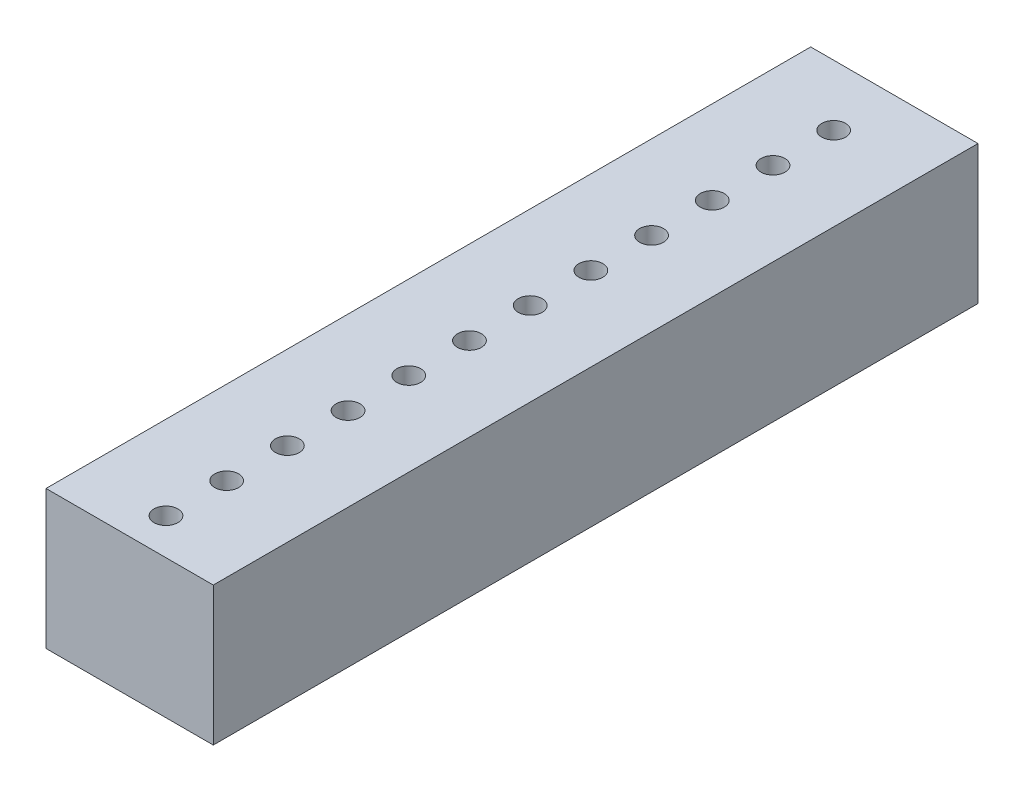
ISO-10303-21;
HEADER;
FILE_DESCRIPTION(('STEP AP214'),'2;1');
FILE_NAME('part.step','',(''),(''),'','','');
FILE_SCHEMA(('AUTOMOTIVE_DESIGN { 1 0 10303 214 1 1 1 1 }'));
ENDSEC;
DATA;
#1=APPLICATION_CONTEXT('core data for automotive mechanical design processes');
#2=APPLICATION_PROTOCOL_DEFINITION('international standard','automotive_design',2000,#1);
#3=PRODUCT_CONTEXT('',#1,'mechanical');
#4=PRODUCT('Part','Part','',(#3));
#5=PRODUCT_RELATED_PRODUCT_CATEGORY('part','',(#4));
#6=PRODUCT_DEFINITION_FORMATION('','',#4);
#7=PRODUCT_DEFINITION_CONTEXT('part definition',#1,'design');
#8=PRODUCT_DEFINITION('design','',#6,#7);
#9=PRODUCT_DEFINITION_SHAPE('','',#8);
#10=(LENGTH_UNIT() NAMED_UNIT(*) SI_UNIT(.MILLI.,.METRE.));
#11=(NAMED_UNIT(*) PLANE_ANGLE_UNIT() SI_UNIT($,.RADIAN.));
#12=(NAMED_UNIT(*) SI_UNIT($,.STERADIAN.) SOLID_ANGLE_UNIT());
#13=UNCERTAINTY_MEASURE_WITH_UNIT(LENGTH_MEASURE(1.E-05),#10,'distance_accuracy_value','');
#14=(GEOMETRIC_REPRESENTATION_CONTEXT(3) GLOBAL_UNCERTAINTY_ASSIGNED_CONTEXT((#13)) GLOBAL_UNIT_ASSIGNED_CONTEXT((#10,
#11,#12)) REPRESENTATION_CONTEXT('',''));
#15=CARTESIAN_POINT('',(0.,0.,0.));
#16=DIRECTION('',(0.,0.,1.));
#17=DIRECTION('',(1.,0.,0.));
#18=AXIS2_PLACEMENT_3D('',#15,#16,#17);
#19=CARTESIAN_POINT('',(0.,-2.9,14.48));
#20=DIRECTION('',(0.,1.,0.));
#21=DIRECTION('',(0.,0.,1.));
#22=AXIS2_PLACEMENT_3D('',#19,#20,#21);
#23=CYLINDRICAL_SURFACE('',#22,0.5);
#24=CARTESIAN_POINT('',(0.,-2.9,14.48));
#25=DIRECTION('',(0.,1.,0.));
#26=DIRECTION('',(0.,0.,1.));
#27=AXIS2_PLACEMENT_3D('',#24,#25,#26);
#28=CIRCLE('',#27,0.5);
#29=CARTESIAN_POINT('',(0.,-2.9,14.98));
#30=VERTEX_POINT('',#29);
#31=EDGE_CURVE('E40',#30,#30,#28,.T.);
#32=ORIENTED_EDGE('',*,*,#31,.F.);
#33=EDGE_LOOP('',(#32));
#34=FACE_BOUND('',#33,.T.);
#35=CARTESIAN_POINT('',(0.,2.9,14.48));
#36=DIRECTION('',(0.,1.,0.));
#37=DIRECTION('',(0.,0.,1.));
#38=AXIS2_PLACEMENT_3D('',#35,#36,#37);
#39=CIRCLE('',#38,0.5);
#40=CARTESIAN_POINT('',(0.,2.9,14.98));
#41=VERTEX_POINT('',#40);
#42=EDGE_CURVE('E11',#41,#41,#39,.T.);
#43=ORIENTED_EDGE('',*,*,#42,.T.);
#44=EDGE_LOOP('',(#43));
#45=FACE_BOUND('',#44,.T.);
#46=ADVANCED_FACE('F32',(#34,#45),#23,.F.);
#47=CARTESIAN_POINT('',(0.,-2.9,11.94));
#48=DIRECTION('',(0.,1.,0.));
#49=DIRECTION('',(0.,0.,1.));
#50=AXIS2_PLACEMENT_3D('',#47,#48,#49);
#51=CYLINDRICAL_SURFACE('',#50,0.5);
#52=CARTESIAN_POINT('',(0.,-2.9,11.94));
#53=DIRECTION('',(0.,1.,0.));
#54=DIRECTION('',(0.,0.,1.));
#55=AXIS2_PLACEMENT_3D('',#52,#53,#54);
#56=CIRCLE('',#55,0.5);
#57=CARTESIAN_POINT('',(0.,-2.9,12.44));
#58=VERTEX_POINT('',#57);
#59=EDGE_CURVE('E161',#58,#58,#56,.T.);
#60=ORIENTED_EDGE('',*,*,#59,.F.);
#61=EDGE_LOOP('',(#60));
#62=FACE_BOUND('',#61,.T.);
#63=CARTESIAN_POINT('',(0.,2.9,11.94));
#64=DIRECTION('',(0.,1.,0.));
#65=DIRECTION('',(0.,0.,1.));
#66=AXIS2_PLACEMENT_3D('',#63,#64,#65);
#67=CIRCLE('',#66,0.5);
#68=CARTESIAN_POINT('',(0.,2.9,12.44));
#69=VERTEX_POINT('',#68);
#70=EDGE_CURVE('E164',#69,#69,#67,.T.);
#71=ORIENTED_EDGE('',*,*,#70,.T.);
#72=EDGE_LOOP('',(#71));
#73=FACE_BOUND('',#72,.T.);
#74=ADVANCED_FACE('F173',(#62,#73),#51,.F.);
#75=CARTESIAN_POINT('',(0.,-2.9,9.4));
#76=DIRECTION('',(0.,1.,0.));
#77=DIRECTION('',(0.,0.,1.));
#78=AXIS2_PLACEMENT_3D('',#75,#76,#77);
#79=CYLINDRICAL_SURFACE('',#78,0.5);
#80=CARTESIAN_POINT('',(0.,-2.9,9.4));
#81=DIRECTION('',(0.,1.,0.));
#82=DIRECTION('',(0.,0.,1.));
#83=AXIS2_PLACEMENT_3D('',#80,#81,#82);
#84=CIRCLE('',#83,0.5);
#85=CARTESIAN_POINT('',(0.,-2.9,9.9));
#86=VERTEX_POINT('',#85);
#87=EDGE_CURVE('E155',#86,#86,#84,.T.);
#88=ORIENTED_EDGE('',*,*,#87,.F.);
#89=EDGE_LOOP('',(#88));
#90=FACE_BOUND('',#89,.T.);
#91=CARTESIAN_POINT('',(0.,2.9,9.4));
#92=DIRECTION('',(0.,1.,0.));
#93=DIRECTION('',(0.,0.,1.));
#94=AXIS2_PLACEMENT_3D('',#91,#92,#93);
#95=CIRCLE('',#94,0.5);
#96=CARTESIAN_POINT('',(0.,2.9,9.9));
#97=VERTEX_POINT('',#96);
#98=EDGE_CURVE('E158',#97,#97,#95,.T.);
#99=ORIENTED_EDGE('',*,*,#98,.T.);
#100=EDGE_LOOP('',(#99));
#101=FACE_BOUND('',#100,.T.);
#102=ADVANCED_FACE('F227',(#90,#101),#79,.F.);
#103=CARTESIAN_POINT('',(0.,-2.9,6.86));
#104=DIRECTION('',(0.,1.,0.));
#105=DIRECTION('',(0.,0.,1.));
#106=AXIS2_PLACEMENT_3D('',#103,#104,#105);
#107=CYLINDRICAL_SURFACE('',#106,0.5);
#108=CARTESIAN_POINT('',(0.,-2.9,6.86));
#109=DIRECTION('',(0.,1.,0.));
#110=DIRECTION('',(0.,0.,1.));
#111=AXIS2_PLACEMENT_3D('',#108,#109,#110);
#112=CIRCLE('',#111,0.5);
#113=CARTESIAN_POINT('',(0.,-2.9,7.36));
#114=VERTEX_POINT('',#113);
#115=EDGE_CURVE('E149',#114,#114,#112,.T.);
#116=ORIENTED_EDGE('',*,*,#115,.F.);
#117=EDGE_LOOP('',(#116));
#118=FACE_BOUND('',#117,.T.);
#119=CARTESIAN_POINT('',(0.,2.9,6.86));
#120=DIRECTION('',(0.,1.,0.));
#121=DIRECTION('',(0.,0.,1.));
#122=AXIS2_PLACEMENT_3D('',#119,#120,#121);
#123=CIRCLE('',#122,0.5);
#124=CARTESIAN_POINT('',(0.,2.9,7.36));
#125=VERTEX_POINT('',#124);
#126=EDGE_CURVE('E152',#125,#125,#123,.T.);
#127=ORIENTED_EDGE('',*,*,#126,.T.);
#128=EDGE_LOOP('',(#127));
#129=FACE_BOUND('',#128,.T.);
#130=ADVANCED_FACE('F223',(#118,#129),#107,.F.);
#131=CARTESIAN_POINT('',(0.,-2.9,4.32));
#132=DIRECTION('',(0.,1.,0.));
#133=DIRECTION('',(0.,0.,1.));
#134=AXIS2_PLACEMENT_3D('',#131,#132,#133);
#135=CYLINDRICAL_SURFACE('',#134,0.5);
#136=CARTESIAN_POINT('',(0.,-2.9,4.32));
#137=DIRECTION('',(0.,1.,0.));
#138=DIRECTION('',(0.,0.,1.));
#139=AXIS2_PLACEMENT_3D('',#136,#137,#138);
#140=CIRCLE('',#139,0.5);
#141=CARTESIAN_POINT('',(0.,-2.9,4.82));
#142=VERTEX_POINT('',#141);
#143=EDGE_CURVE('E143',#142,#142,#140,.T.);
#144=ORIENTED_EDGE('',*,*,#143,.F.);
#145=EDGE_LOOP('',(#144));
#146=FACE_BOUND('',#145,.T.);
#147=CARTESIAN_POINT('',(0.,2.9,4.32));
#148=DIRECTION('',(0.,1.,0.));
#149=DIRECTION('',(0.,0.,1.));
#150=AXIS2_PLACEMENT_3D('',#147,#148,#149);
#151=CIRCLE('',#150,0.5);
#152=CARTESIAN_POINT('',(0.,2.9,4.82));
#153=VERTEX_POINT('',#152);
#154=EDGE_CURVE('E146',#153,#153,#151,.T.);
#155=ORIENTED_EDGE('',*,*,#154,.T.);
#156=EDGE_LOOP('',(#155));
#157=FACE_BOUND('',#156,.T.);
#158=ADVANCED_FACE('F219',(#146,#157),#135,.F.);
#159=CARTESIAN_POINT('',(0.,-2.9,1.78));
#160=DIRECTION('',(0.,1.,0.));
#161=DIRECTION('',(0.,0.,1.));
#162=AXIS2_PLACEMENT_3D('',#159,#160,#161);
#163=CYLINDRICAL_SURFACE('',#162,0.5);
#164=CARTESIAN_POINT('',(0.,-2.9,1.78));
#165=DIRECTION('',(0.,1.,0.));
#166=DIRECTION('',(0.,0.,1.));
#167=AXIS2_PLACEMENT_3D('',#164,#165,#166);
#168=CIRCLE('',#167,0.5);
#169=CARTESIAN_POINT('',(0.,-2.9,2.28));
#170=VERTEX_POINT('',#169);
#171=EDGE_CURVE('E137',#170,#170,#168,.T.);
#172=ORIENTED_EDGE('',*,*,#171,.F.);
#173=EDGE_LOOP('',(#172));
#174=FACE_BOUND('',#173,.T.);
#175=CARTESIAN_POINT('',(0.,2.9,1.78));
#176=DIRECTION('',(0.,1.,0.));
#177=DIRECTION('',(0.,0.,1.));
#178=AXIS2_PLACEMENT_3D('',#175,#176,#177);
#179=CIRCLE('',#178,0.5);
#180=CARTESIAN_POINT('',(0.,2.9,2.28));
#181=VERTEX_POINT('',#180);
#182=EDGE_CURVE('E140',#181,#181,#179,.T.);
#183=ORIENTED_EDGE('',*,*,#182,.T.);
#184=EDGE_LOOP('',(#183));
#185=FACE_BOUND('',#184,.T.);
#186=ADVANCED_FACE('F215',(#174,#185),#163,.F.);
#187=CARTESIAN_POINT('',(0.,-2.9,-0.759999999999999));
#188=DIRECTION('',(0.,1.,0.));
#189=DIRECTION('',(0.,0.,1.));
#190=AXIS2_PLACEMENT_3D('',#187,#188,#189);
#191=CYLINDRICAL_SURFACE('',#190,0.5);
#192=CARTESIAN_POINT('',(0.,-2.9,-0.759999999999999));
#193=DIRECTION('',(0.,1.,0.));
#194=DIRECTION('',(0.,0.,1.));
#195=AXIS2_PLACEMENT_3D('',#192,#193,#194);
#196=CIRCLE('',#195,0.5);
#197=CARTESIAN_POINT('',(0.,-2.9,-0.259999999999998));
#198=VERTEX_POINT('',#197);
#199=EDGE_CURVE('E131',#198,#198,#196,.T.);
#200=ORIENTED_EDGE('',*,*,#199,.F.);
#201=EDGE_LOOP('',(#200));
#202=FACE_BOUND('',#201,.T.);
#203=CARTESIAN_POINT('',(0.,2.9,-0.759999999999999));
#204=DIRECTION('',(0.,1.,0.));
#205=DIRECTION('',(0.,0.,1.));
#206=AXIS2_PLACEMENT_3D('',#203,#204,#205);
#207=CIRCLE('',#206,0.5);
#208=CARTESIAN_POINT('',(0.,2.9,-0.259999999999998));
#209=VERTEX_POINT('',#208);
#210=EDGE_CURVE('E134',#209,#209,#207,.T.);
#211=ORIENTED_EDGE('',*,*,#210,.T.);
#212=EDGE_LOOP('',(#211));
#213=FACE_BOUND('',#212,.T.);
#214=ADVANCED_FACE('F211',(#202,#213),#191,.F.);
#215=CARTESIAN_POINT('',(0.,-2.9,-3.3));
#216=DIRECTION('',(0.,1.,0.));
#217=DIRECTION('',(0.,0.,1.));
#218=AXIS2_PLACEMENT_3D('',#215,#216,#217);
#219=CYLINDRICAL_SURFACE('',#218,0.5);
#220=CARTESIAN_POINT('',(0.,-2.9,-3.3));
#221=DIRECTION('',(0.,1.,0.));
#222=DIRECTION('',(0.,0.,1.));
#223=AXIS2_PLACEMENT_3D('',#220,#221,#222);
#224=CIRCLE('',#223,0.5);
#225=CARTESIAN_POINT('',(0.,-2.9,-2.8));
#226=VERTEX_POINT('',#225);
#227=EDGE_CURVE('E125',#226,#226,#224,.T.);
#228=ORIENTED_EDGE('',*,*,#227,.F.);
#229=EDGE_LOOP('',(#228));
#230=FACE_BOUND('',#229,.T.);
#231=CARTESIAN_POINT('',(0.,2.9,-3.3));
#232=DIRECTION('',(0.,1.,0.));
#233=DIRECTION('',(0.,0.,1.));
#234=AXIS2_PLACEMENT_3D('',#231,#232,#233);
#235=CIRCLE('',#234,0.5);
#236=CARTESIAN_POINT('',(0.,2.9,-2.8));
#237=VERTEX_POINT('',#236);
#238=EDGE_CURVE('E128',#237,#237,#235,.T.);
#239=ORIENTED_EDGE('',*,*,#238,.T.);
#240=EDGE_LOOP('',(#239));
#241=FACE_BOUND('',#240,.T.);
#242=ADVANCED_FACE('F207',(#230,#241),#219,.F.);
#243=CARTESIAN_POINT('',(0.,-2.9,-5.84));
#244=DIRECTION('',(0.,1.,0.));
#245=DIRECTION('',(0.,0.,1.));
#246=AXIS2_PLACEMENT_3D('',#243,#244,#245);
#247=CYLINDRICAL_SURFACE('',#246,0.5);
#248=CARTESIAN_POINT('',(0.,-2.9,-5.84));
#249=DIRECTION('',(0.,1.,0.));
#250=DIRECTION('',(0.,0.,1.));
#251=AXIS2_PLACEMENT_3D('',#248,#249,#250);
#252=CIRCLE('',#251,0.5);
#253=CARTESIAN_POINT('',(0.,-2.9,-5.34));
#254=VERTEX_POINT('',#253);
#255=EDGE_CURVE('E119',#254,#254,#252,.T.);
#256=ORIENTED_EDGE('',*,*,#255,.F.);
#257=EDGE_LOOP('',(#256));
#258=FACE_BOUND('',#257,.T.);
#259=CARTESIAN_POINT('',(0.,2.9,-5.84));
#260=DIRECTION('',(0.,1.,0.));
#261=DIRECTION('',(0.,0.,1.));
#262=AXIS2_PLACEMENT_3D('',#259,#260,#261);
#263=CIRCLE('',#262,0.5);
#264=CARTESIAN_POINT('',(0.,2.9,-5.34));
#265=VERTEX_POINT('',#264);
#266=EDGE_CURVE('E122',#265,#265,#263,.T.);
#267=ORIENTED_EDGE('',*,*,#266,.T.);
#268=EDGE_LOOP('',(#267));
#269=FACE_BOUND('',#268,.T.);
#270=ADVANCED_FACE('F203',(#258,#269),#247,.F.);
#271=CARTESIAN_POINT('',(0.,-2.9,-8.38));
#272=DIRECTION('',(0.,1.,0.));
#273=DIRECTION('',(0.,0.,1.));
#274=AXIS2_PLACEMENT_3D('',#271,#272,#273);
#275=CYLINDRICAL_SURFACE('',#274,0.5);
#276=CARTESIAN_POINT('',(0.,-2.9,-8.38));
#277=DIRECTION('',(0.,1.,0.));
#278=DIRECTION('',(0.,0.,1.));
#279=AXIS2_PLACEMENT_3D('',#276,#277,#278);
#280=CIRCLE('',#279,0.5);
#281=CARTESIAN_POINT('',(0.,-2.9,-7.88));
#282=VERTEX_POINT('',#281);
#283=EDGE_CURVE('E111',#282,#282,#280,.T.);
#284=ORIENTED_EDGE('',*,*,#283,.F.);
#285=EDGE_LOOP('',(#284));
#286=FACE_BOUND('',#285,.T.);
#287=CARTESIAN_POINT('',(0.,2.9,-8.38));
#288=DIRECTION('',(0.,1.,0.));
#289=DIRECTION('',(0.,0.,1.));
#290=AXIS2_PLACEMENT_3D('',#287,#288,#289);
#291=CIRCLE('',#290,0.5);
#292=CARTESIAN_POINT('',(0.,2.9,-7.88));
#293=VERTEX_POINT('',#292);
#294=EDGE_CURVE('E116',#293,#293,#291,.T.);
#295=ORIENTED_EDGE('',*,*,#294,.T.);
#296=EDGE_LOOP('',(#295));
#297=FACE_BOUND('',#296,.T.);
#298=ADVANCED_FACE('F200',(#286,#297),#275,.F.);
#299=CARTESIAN_POINT('',(3.5,2.9,16.));
#300=DIRECTION('',(0.,0.,1.));
#301=DIRECTION('',(1.,0.,0.));
#302=AXIS2_PLACEMENT_3D('',#299,#300,#301);
#303=PLANE('',#302);
#304=DIRECTION('',(-1.,0.,0.));
#305=VECTOR('',#304,1.);
#306=CARTESIAN_POINT('',(3.5,-2.9,16.));
#307=LINE('',#306,#305);
#308=CARTESIAN_POINT('',(3.5,-2.9,16.));
#309=VERTEX_POINT('',#308);
#310=CARTESIAN_POINT('',(-3.5,-2.9,16.));
#311=VERTEX_POINT('',#310);
#312=EDGE_CURVE('E101',#309,#311,#307,.T.);
#313=ORIENTED_EDGE('',*,*,#312,.F.);
#314=DIRECTION('',(0.,-1.,0.));
#315=VECTOR('',#314,1.);
#316=CARTESIAN_POINT('',(3.5,2.9,16.));
#317=LINE('',#316,#315);
#318=CARTESIAN_POINT('',(3.5,2.9,16.));
#319=VERTEX_POINT('',#318);
#320=EDGE_CURVE('E48',#319,#309,#317,.T.);
#321=ORIENTED_EDGE('',*,*,#320,.F.);
#322=DIRECTION('',(-1.,0.,0.));
#323=VECTOR('',#322,1.);
#324=CARTESIAN_POINT('',(3.5,2.9,16.));
#325=LINE('',#324,#323);
#326=CARTESIAN_POINT('',(-3.5,2.9,16.));
#327=VERTEX_POINT('',#326);
#328=EDGE_CURVE('E94',#319,#327,#325,.T.);
#329=ORIENTED_EDGE('',*,*,#328,.T.);
#330=DIRECTION('',(0.,-1.,0.));
#331=VECTOR('',#330,1.);
#332=CARTESIAN_POINT('',(-3.5,2.9,16.));
#333=LINE('',#332,#331);
#334=EDGE_CURVE('E91',#327,#311,#333,.T.);
#335=ORIENTED_EDGE('',*,*,#334,.T.);
#336=EDGE_LOOP('',(#313,#321,#329,#335));
#337=FACE_BOUND('',#336,.T.);
#338=ADVANCED_FACE('F195',(#337),#303,.T.);
#339=CARTESIAN_POINT('',(3.5,2.9,-16.));
#340=DIRECTION('',(1.,0.,0.));
#341=DIRECTION('',(0.,0.,-1.));
#342=AXIS2_PLACEMENT_3D('',#339,#340,#341);
#343=PLANE('',#342);
#344=DIRECTION('',(0.,0.,1.));
#345=VECTOR('',#344,1.);
#346=CARTESIAN_POINT('',(3.5,-2.9,-16.));
#347=LINE('',#346,#345);
#348=CARTESIAN_POINT('',(3.5,-2.9,-16.));
#349=VERTEX_POINT('',#348);
#350=EDGE_CURVE('E96',#349,#309,#347,.T.);
#351=ORIENTED_EDGE('',*,*,#350,.F.);
#352=DIRECTION('',(0.,-1.,0.));
#353=VECTOR('',#352,1.);
#354=CARTESIAN_POINT('',(3.5,2.9,-16.));
#355=LINE('',#354,#353);
#356=CARTESIAN_POINT('',(3.5,2.9,-16.));
#357=VERTEX_POINT('',#356);
#358=EDGE_CURVE('E64',#357,#349,#355,.T.);
#359=ORIENTED_EDGE('',*,*,#358,.F.);
#360=DIRECTION('',(0.,0.,1.));
#361=VECTOR('',#360,1.);
#362=CARTESIAN_POINT('',(3.5,2.9,-16.));
#363=LINE('',#362,#361);
#364=EDGE_CURVE('E82',#357,#319,#363,.T.);
#365=ORIENTED_EDGE('',*,*,#364,.T.);
#366=ORIENTED_EDGE('',*,*,#320,.T.);
#367=EDGE_LOOP('',(#351,#359,#365,#366));
#368=FACE_BOUND('',#367,.T.);
#369=ADVANCED_FACE('F192',(#368),#343,.T.);
#370=CARTESIAN_POINT('',(3.5,2.9,-16.));
#371=DIRECTION('',(0.,0.,1.));
#372=DIRECTION('',(1.,0.,0.));
#373=AXIS2_PLACEMENT_3D('',#370,#371,#372);
#374=PLANE('',#373);
#375=DIRECTION('',(-1.,0.,0.));
#376=VECTOR('',#375,1.);
#377=CARTESIAN_POINT('',(3.5,-2.9,-16.));
#378=LINE('',#377,#376);
#379=CARTESIAN_POINT('',(-3.5,-2.9,-16.));
#380=VERTEX_POINT('',#379);
#381=EDGE_CURVE('E87',#349,#380,#378,.T.);
#382=ORIENTED_EDGE('',*,*,#381,.T.);
#383=DIRECTION('',(0.,-1.,0.));
#384=VECTOR('',#383,1.);
#385=CARTESIAN_POINT('',(-3.5,2.9,-16.));
#386=LINE('',#385,#384);
#387=CARTESIAN_POINT('',(-3.5,2.9,-16.));
#388=VERTEX_POINT('',#387);
#389=EDGE_CURVE('E85',#388,#380,#386,.T.);
#390=ORIENTED_EDGE('',*,*,#389,.F.);
#391=DIRECTION('',(-1.,0.,0.));
#392=VECTOR('',#391,1.);
#393=CARTESIAN_POINT('',(3.5,2.9,-16.));
#394=LINE('',#393,#392);
#395=EDGE_CURVE('E78',#357,#388,#394,.T.);
#396=ORIENTED_EDGE('',*,*,#395,.F.);
#397=ORIENTED_EDGE('',*,*,#358,.T.);
#398=EDGE_LOOP('',(#382,#390,#396,#397));
#399=FACE_BOUND('',#398,.T.);
#400=ADVANCED_FACE('F86',(#399),#374,.F.);
#401=CARTESIAN_POINT('',(-3.5,2.9,-16.));
#402=DIRECTION('',(1.,0.,0.));
#403=DIRECTION('',(0.,0.,-1.));
#404=AXIS2_PLACEMENT_3D('',#401,#402,#403);
#405=PLANE('',#404);
#406=DIRECTION('',(0.,0.,1.));
#407=VECTOR('',#406,1.);
#408=CARTESIAN_POINT('',(-3.5,-2.9,-16.));
#409=LINE('',#408,#407);
#410=EDGE_CURVE('E104',#380,#311,#409,.T.);
#411=ORIENTED_EDGE('',*,*,#410,.T.);
#412=ORIENTED_EDGE('',*,*,#334,.F.);
#413=DIRECTION('',(0.,0.,1.));
#414=VECTOR('',#413,1.);
#415=CARTESIAN_POINT('',(-3.5,2.9,-16.));
#416=LINE('',#415,#414);
#417=EDGE_CURVE('E75',#388,#327,#416,.T.);
#418=ORIENTED_EDGE('',*,*,#417,.F.);
#419=ORIENTED_EDGE('',*,*,#389,.T.);
#420=EDGE_LOOP('',(#411,#412,#418,#419));
#421=FACE_BOUND('',#420,.T.);
#422=ADVANCED_FACE('F93',(#421),#405,.F.);
#423=CARTESIAN_POINT('',(0.,2.9,0.));
#424=DIRECTION('',(0.,1.,0.));
#425=DIRECTION('',(0.,0.,1.));
#426=AXIS2_PLACEMENT_3D('',#423,#424,#425);
#427=PLANE('',#426);
#428=CARTESIAN_POINT('',(0.,2.9,-10.92));
#429=DIRECTION('',(0.,1.,0.));
#430=DIRECTION('',(0.,0.,1.));
#431=AXIS2_PLACEMENT_3D('',#428,#429,#430);
#432=CIRCLE('',#431,0.5);
#433=CARTESIAN_POINT('',(0.,2.9,-10.42));
#434=VERTEX_POINT('',#433);
#435=EDGE_CURVE('E348',#434,#434,#432,.T.);
#436=ORIENTED_EDGE('',*,*,#435,.F.);
#437=EDGE_LOOP('',(#436));
#438=FACE_BOUND('',#437,.T.);
#439=CARTESIAN_POINT('',(0.,2.9,-13.46));
#440=DIRECTION('',(0.,1.,0.));
#441=DIRECTION('',(0.,0.,1.));
#442=AXIS2_PLACEMENT_3D('',#439,#440,#441);
#443=CIRCLE('',#442,0.5);
#444=CARTESIAN_POINT('',(0.,2.9,-12.96));
#445=VERTEX_POINT('',#444);
#446=EDGE_CURVE('E349',#445,#445,#443,.T.);
#447=ORIENTED_EDGE('',*,*,#446,.F.);
#448=EDGE_LOOP('',(#447));
#449=FACE_BOUND('',#448,.T.);
#450=ORIENTED_EDGE('',*,*,#328,.F.);
#451=ORIENTED_EDGE('',*,*,#364,.F.);
#452=ORIENTED_EDGE('',*,*,#395,.T.);
#453=ORIENTED_EDGE('',*,*,#417,.T.);
#454=EDGE_LOOP('',(#450,#451,#452,#453));
#455=FACE_BOUND('',#454,.T.);
#456=ORIENTED_EDGE('',*,*,#294,.F.);
#457=EDGE_LOOP('',(#456));
#458=FACE_BOUND('',#457,.T.);
#459=ORIENTED_EDGE('',*,*,#266,.F.);
#460=EDGE_LOOP('',(#459));
#461=FACE_BOUND('',#460,.T.);
#462=ORIENTED_EDGE('',*,*,#238,.F.);
#463=EDGE_LOOP('',(#462));
#464=FACE_BOUND('',#463,.T.);
#465=ORIENTED_EDGE('',*,*,#210,.F.);
#466=EDGE_LOOP('',(#465));
#467=FACE_BOUND('',#466,.T.);
#468=ORIENTED_EDGE('',*,*,#182,.F.);
#469=EDGE_LOOP('',(#468));
#470=FACE_BOUND('',#469,.T.);
#471=ORIENTED_EDGE('',*,*,#154,.F.);
#472=EDGE_LOOP('',(#471));
#473=FACE_BOUND('',#472,.T.);
#474=ORIENTED_EDGE('',*,*,#126,.F.);
#475=EDGE_LOOP('',(#474));
#476=FACE_BOUND('',#475,.T.);
#477=ORIENTED_EDGE('',*,*,#98,.F.);
#478=EDGE_LOOP('',(#477));
#479=FACE_BOUND('',#478,.T.);
#480=ORIENTED_EDGE('',*,*,#70,.F.);
#481=EDGE_LOOP('',(#480));
#482=FACE_BOUND('',#481,.T.);
#483=ORIENTED_EDGE('',*,*,#42,.F.);
#484=EDGE_LOOP('',(#483));
#485=FACE_BOUND('',#484,.T.);
#486=ADVANCED_FACE('F80',(#438,#449,#455,#458,#461,#464,#467,#470,#473,#476,#479,#482,#485),
#427,.T.);
#487=CARTESIAN_POINT('',(0.,-2.9,0.));
#488=DIRECTION('',(0.,1.,0.));
#489=DIRECTION('',(0.,0.,1.));
#490=AXIS2_PLACEMENT_3D('',#487,#488,#489);
#491=PLANE('',#490);
#492=CARTESIAN_POINT('',(0.,-2.9,-10.92));
#493=DIRECTION('',(0.,1.,0.));
#494=DIRECTION('',(0.,0.,1.));
#495=AXIS2_PLACEMENT_3D('',#492,#493,#494);
#496=CIRCLE('',#495,0.5);
#497=CARTESIAN_POINT('',(0.,-2.9,-10.42));
#498=VERTEX_POINT('',#497);
#499=EDGE_CURVE('E346',#498,#498,#496,.T.);
#500=ORIENTED_EDGE('',*,*,#499,.T.);
#501=EDGE_LOOP('',(#500));
#502=FACE_BOUND('',#501,.T.);
#503=CARTESIAN_POINT('',(0.,-2.9,-13.46));
#504=DIRECTION('',(0.,1.,0.));
#505=DIRECTION('',(0.,0.,1.));
#506=AXIS2_PLACEMENT_3D('',#503,#504,#505);
#507=CIRCLE('',#506,0.5);
#508=CARTESIAN_POINT('',(0.,-2.9,-12.96));
#509=VERTEX_POINT('',#508);
#510=EDGE_CURVE('E105',#509,#509,#507,.T.);
#511=ORIENTED_EDGE('',*,*,#510,.T.);
#512=EDGE_LOOP('',(#511));
#513=FACE_BOUND('',#512,.T.);
#514=ORIENTED_EDGE('',*,*,#312,.T.);
#515=ORIENTED_EDGE('',*,*,#410,.F.);
#516=ORIENTED_EDGE('',*,*,#381,.F.);
#517=ORIENTED_EDGE('',*,*,#350,.T.);
#518=EDGE_LOOP('',(#514,#515,#516,#517));
#519=FACE_BOUND('',#518,.T.);
#520=ORIENTED_EDGE('',*,*,#283,.T.);
#521=EDGE_LOOP('',(#520));
#522=FACE_BOUND('',#521,.T.);
#523=ORIENTED_EDGE('',*,*,#255,.T.);
#524=EDGE_LOOP('',(#523));
#525=FACE_BOUND('',#524,.T.);
#526=ORIENTED_EDGE('',*,*,#227,.T.);
#527=EDGE_LOOP('',(#526));
#528=FACE_BOUND('',#527,.T.);
#529=ORIENTED_EDGE('',*,*,#199,.T.);
#530=EDGE_LOOP('',(#529));
#531=FACE_BOUND('',#530,.T.);
#532=ORIENTED_EDGE('',*,*,#171,.T.);
#533=EDGE_LOOP('',(#532));
#534=FACE_BOUND('',#533,.T.);
#535=ORIENTED_EDGE('',*,*,#143,.T.);
#536=EDGE_LOOP('',(#535));
#537=FACE_BOUND('',#536,.T.);
#538=ORIENTED_EDGE('',*,*,#115,.T.);
#539=EDGE_LOOP('',(#538));
#540=FACE_BOUND('',#539,.T.);
#541=ORIENTED_EDGE('',*,*,#87,.T.);
#542=EDGE_LOOP('',(#541));
#543=FACE_BOUND('',#542,.T.);
#544=ORIENTED_EDGE('',*,*,#59,.T.);
#545=EDGE_LOOP('',(#544));
#546=FACE_BOUND('',#545,.T.);
#547=ORIENTED_EDGE('',*,*,#31,.T.);
#548=EDGE_LOOP('',(#547));
#549=FACE_BOUND('',#548,.T.);
#550=ADVANCED_FACE('F169',(#502,#513,#519,#522,#525,#528,#531,#534,#537,#540,#543,#546,#549),
#491,.F.);
#551=CARTESIAN_POINT('',(0.,-2.9,-13.46));
#552=DIRECTION('',(0.,1.,0.));
#553=DIRECTION('',(0.,0.,1.));
#554=AXIS2_PLACEMENT_3D('',#551,#552,#553);
#555=CYLINDRICAL_SURFACE('',#554,0.5);
#556=ORIENTED_EDGE('',*,*,#510,.F.);
#557=EDGE_LOOP('',(#556));
#558=FACE_BOUND('',#557,.T.);
#559=ORIENTED_EDGE('',*,*,#446,.T.);
#560=EDGE_LOOP('',(#559));
#561=FACE_BOUND('',#560,.T.);
#562=ADVANCED_FACE('F183',(#558,#561),#555,.F.);
#563=CARTESIAN_POINT('',(0.,-2.9,-10.92));
#564=DIRECTION('',(0.,1.,0.));
#565=DIRECTION('',(0.,0.,1.));
#566=AXIS2_PLACEMENT_3D('',#563,#564,#565);
#567=CYLINDRICAL_SURFACE('',#566,0.5);
#568=ORIENTED_EDGE('',*,*,#499,.F.);
#569=EDGE_LOOP('',(#568));
#570=FACE_BOUND('',#569,.T.);
#571=ORIENTED_EDGE('',*,*,#435,.T.);
#572=EDGE_LOOP('',(#571));
#573=FACE_BOUND('',#572,.T.);
#574=ADVANCED_FACE('F299',(#570,#573),#567,.F.);
#575=CLOSED_SHELL('',(#46,#74,#102,#130,#158,#186,#214,#242,#270,#298,#338,#369,#400,#422,#486,
#550,#562,#574));
#576=MANIFOLD_SOLID_BREP('B2',#575);
#577=ADVANCED_BREP_SHAPE_REPRESENTATION('',(#18,#576),#14);
#578=SHAPE_DEFINITION_REPRESENTATION(#9,#577);
ENDSEC;
END-ISO-10303-21;
